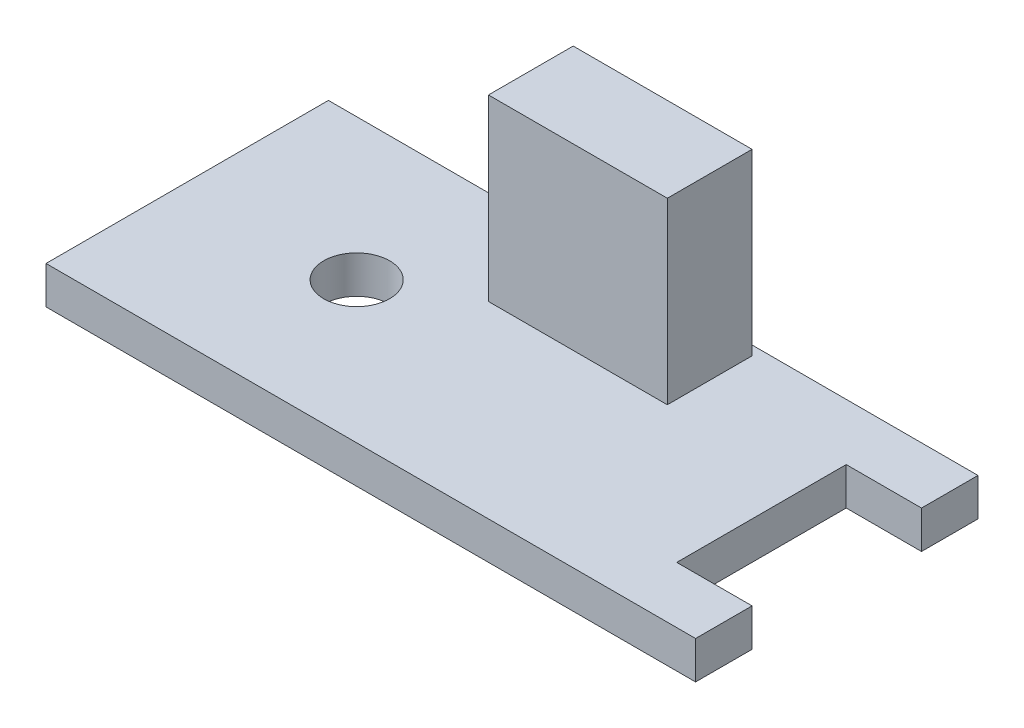
ISO-10303-21;
HEADER;
FILE_DESCRIPTION(('STEP AP214'),'2;1');
FILE_NAME('part.step','',(''),(''),'','','');
FILE_SCHEMA(('AUTOMOTIVE_DESIGN { 1 0 10303 214 1 1 1 1 }'));
ENDSEC;
DATA;
#1=APPLICATION_CONTEXT('core data for automotive mechanical design processes');
#2=APPLICATION_PROTOCOL_DEFINITION('international standard','automotive_design',2000,#1);
#3=PRODUCT_CONTEXT('',#1,'mechanical');
#4=PRODUCT('Part','Part','',(#3));
#5=PRODUCT_RELATED_PRODUCT_CATEGORY('part','',(#4));
#6=PRODUCT_DEFINITION_FORMATION('','',#4);
#7=PRODUCT_DEFINITION_CONTEXT('part definition',#1,'design');
#8=PRODUCT_DEFINITION('design','',#6,#7);
#9=PRODUCT_DEFINITION_SHAPE('','',#8);
#10=(LENGTH_UNIT() NAMED_UNIT(*) SI_UNIT(.MILLI.,.METRE.));
#11=(NAMED_UNIT(*) PLANE_ANGLE_UNIT() SI_UNIT($,.RADIAN.));
#12=(NAMED_UNIT(*) SI_UNIT($,.STERADIAN.) SOLID_ANGLE_UNIT());
#13=UNCERTAINTY_MEASURE_WITH_UNIT(LENGTH_MEASURE(1.E-05),#10,'distance_accuracy_value','');
#14=(GEOMETRIC_REPRESENTATION_CONTEXT(3) GLOBAL_UNCERTAINTY_ASSIGNED_CONTEXT((#13)) GLOBAL_UNIT_ASSIGNED_CONTEXT((#10,
#11,#12)) REPRESENTATION_CONTEXT('',''));
#15=CARTESIAN_POINT('',(0.,0.,0.));
#16=DIRECTION('',(0.,0.,1.));
#17=DIRECTION('',(1.,0.,0.));
#18=AXIS2_PLACEMENT_3D('',#15,#16,#17);
#19=CARTESIAN_POINT('',(0.,2.,0.));
#20=DIRECTION('',(0.,-1.,0.));
#21=DIRECTION('',(0.,0.,-1.));
#22=AXIS2_PLACEMENT_3D('',#19,#20,#21);
#23=PLANE('',#22);
#24=CARTESIAN_POINT('',(-8.25,2.,0.));
#25=DIRECTION('',(0.,1.,0.));
#26=DIRECTION('',(0.,0.,1.));
#27=AXIS2_PLACEMENT_3D('',#24,#25,#26);
#28=CIRCLE('',#27,1.75);
#29=CARTESIAN_POINT('',(-8.25,2.,1.75));
#30=VERTEX_POINT('',#29);
#31=EDGE_CURVE('E145',#30,#30,#28,.T.);
#32=ORIENTED_EDGE('',*,*,#31,.F.);
#33=EDGE_LOOP('',(#32));
#34=FACE_BOUND('',#33,.T.);
#35=DIRECTION('',(0.,0.,-1.));
#36=VECTOR('',#35,1.);
#37=CARTESIAN_POINT('',(17.25,2.,-4.5));
#38=LINE('',#37,#36);
#39=CARTESIAN_POINT('',(17.25,2.,-4.5));
#40=VERTEX_POINT('',#39);
#41=CARTESIAN_POINT('',(17.25,2.,-7.5));
#42=VERTEX_POINT('',#41);
#43=EDGE_CURVE('E154',#40,#42,#38,.T.);
#44=ORIENTED_EDGE('',*,*,#43,.T.);
#45=DIRECTION('',(-1.,0.,0.));
#46=VECTOR('',#45,1.);
#47=CARTESIAN_POINT('',(-17.25,2.,-7.5));
#48=LINE('',#47,#46);
#49=CARTESIAN_POINT('',(-17.25,2.,-7.5));
#50=VERTEX_POINT('',#49);
#51=EDGE_CURVE('E157',#42,#50,#48,.T.);
#52=ORIENTED_EDGE('',*,*,#51,.T.);
#53=DIRECTION('',(0.,0.,1.));
#54=VECTOR('',#53,1.);
#55=CARTESIAN_POINT('',(-17.25,2.,7.5));
#56=LINE('',#55,#54);
#57=CARTESIAN_POINT('',(-17.25,2.,7.5));
#58=VERTEX_POINT('',#57);
#59=EDGE_CURVE('E160',#50,#58,#56,.T.);
#60=ORIENTED_EDGE('',*,*,#59,.T.);
#61=DIRECTION('',(1.,0.,0.));
#62=VECTOR('',#61,1.);
#63=CARTESIAN_POINT('',(-17.25,2.,7.5));
#64=LINE('',#63,#62);
#65=CARTESIAN_POINT('',(17.25,2.,7.5));
#66=VERTEX_POINT('',#65);
#67=EDGE_CURVE('E162',#58,#66,#64,.T.);
#68=ORIENTED_EDGE('',*,*,#67,.T.);
#69=DIRECTION('',(0.,0.,-1.));
#70=VECTOR('',#69,1.);
#71=CARTESIAN_POINT('',(17.25,2.,7.5));
#72=LINE('',#71,#70);
#73=CARTESIAN_POINT('',(17.25,2.,4.5));
#74=VERTEX_POINT('',#73);
#75=EDGE_CURVE('E164',#66,#74,#72,.T.);
#76=ORIENTED_EDGE('',*,*,#75,.T.);
#77=DIRECTION('',(-1.,0.,0.));
#78=VECTOR('',#77,1.);
#79=CARTESIAN_POINT('',(13.25,2.,4.5));
#80=LINE('',#79,#78);
#81=CARTESIAN_POINT('',(13.25,2.,4.5));
#82=VERTEX_POINT('',#81);
#83=EDGE_CURVE('E166',#74,#82,#80,.T.);
#84=ORIENTED_EDGE('',*,*,#83,.T.);
#85=DIRECTION('',(0.,0.,-1.));
#86=VECTOR('',#85,1.);
#87=CARTESIAN_POINT('',(13.25,2.,-4.5));
#88=LINE('',#87,#86);
#89=CARTESIAN_POINT('',(13.25,2.,-4.5));
#90=VERTEX_POINT('',#89);
#91=EDGE_CURVE('E168',#82,#90,#88,.T.);
#92=ORIENTED_EDGE('',*,*,#91,.T.);
#93=DIRECTION('',(1.,0.,0.));
#94=VECTOR('',#93,1.);
#95=CARTESIAN_POINT('',(17.25,2.,-4.5));
#96=LINE('',#95,#94);
#97=EDGE_CURVE('E170',#90,#40,#96,.T.);
#98=ORIENTED_EDGE('',*,*,#97,.T.);
#99=EDGE_LOOP('',(#44,#52,#60,#68,#76,#84,#92,#98));
#100=FACE_BOUND('',#99,.T.);
#101=DIRECTION('',(0.,0.,-1.));
#102=VECTOR('',#101,1.);
#103=CARTESIAN_POINT('',(5.74999999999999,2.,-7.));
#104=LINE('',#103,#102);
#105=CARTESIAN_POINT('',(5.74999999999999,2.,-2.5));
#106=VERTEX_POINT('',#105);
#107=CARTESIAN_POINT('',(5.74999999999999,2.,-7.));
#108=VERTEX_POINT('',#107);
#109=EDGE_CURVE('E141',#106,#108,#104,.T.);
#110=ORIENTED_EDGE('',*,*,#109,.F.);
#111=DIRECTION('',(1.,0.,0.));
#112=VECTOR('',#111,1.);
#113=CARTESIAN_POINT('',(-3.75,2.,-2.5));
#114=LINE('',#113,#112);
#115=CARTESIAN_POINT('',(-3.75,2.,-2.5));
#116=VERTEX_POINT('',#115);
#117=EDGE_CURVE('E138',#116,#106,#114,.T.);
#118=ORIENTED_EDGE('',*,*,#117,.F.);
#119=DIRECTION('',(0.,0.,1.));
#120=VECTOR('',#119,1.);
#121=CARTESIAN_POINT('',(-3.75,2.,-7.));
#122=LINE('',#121,#120);
#123=CARTESIAN_POINT('',(-3.75,2.,-7.));
#124=VERTEX_POINT('',#123);
#125=EDGE_CURVE('E52',#124,#116,#122,.T.);
#126=ORIENTED_EDGE('',*,*,#125,.F.);
#127=DIRECTION('',(-1.,0.,0.));
#128=VECTOR('',#127,1.);
#129=CARTESIAN_POINT('',(-3.75,2.,-7.));
#130=LINE('',#129,#128);
#131=EDGE_CURVE('E47',#108,#124,#130,.T.);
#132=ORIENTED_EDGE('',*,*,#131,.F.);
#133=EDGE_LOOP('',(#110,#118,#126,#132));
#134=FACE_BOUND('',#133,.T.);
#135=ADVANCED_FACE('F32',(#34,#100,#134),#23,.F.);
#136=CARTESIAN_POINT('',(0.,0.,0.));
#137=DIRECTION('',(0.,-1.,0.));
#138=DIRECTION('',(0.,0.,-1.));
#139=AXIS2_PLACEMENT_3D('',#136,#137,#138);
#140=PLANE('',#139);
#141=DIRECTION('',(0.,0.,-1.));
#142=VECTOR('',#141,1.);
#143=CARTESIAN_POINT('',(17.25,0.,-4.5));
#144=LINE('',#143,#142);
#145=CARTESIAN_POINT('',(17.25,0.,-4.5));
#146=VERTEX_POINT('',#145);
#147=CARTESIAN_POINT('',(17.25,0.,-7.5));
#148=VERTEX_POINT('',#147);
#149=EDGE_CURVE('E152',#146,#148,#144,.T.);
#150=ORIENTED_EDGE('',*,*,#149,.F.);
#151=DIRECTION('',(1.,0.,0.));
#152=VECTOR('',#151,1.);
#153=CARTESIAN_POINT('',(17.25,0.,-4.5));
#154=LINE('',#153,#152);
#155=CARTESIAN_POINT('',(13.25,0.,-4.5));
#156=VERTEX_POINT('',#155);
#157=EDGE_CURVE('E158',#156,#146,#154,.T.);
#158=ORIENTED_EDGE('',*,*,#157,.F.);
#159=DIRECTION('',(0.,0.,-1.));
#160=VECTOR('',#159,1.);
#161=CARTESIAN_POINT('',(13.25,0.,-4.5));
#162=LINE('',#161,#160);
#163=CARTESIAN_POINT('',(13.25,0.,4.5));
#164=VERTEX_POINT('',#163);
#165=EDGE_CURVE('E185',#164,#156,#162,.T.);
#166=ORIENTED_EDGE('',*,*,#165,.F.);
#167=DIRECTION('',(-1.,0.,0.));
#168=VECTOR('',#167,1.);
#169=CARTESIAN_POINT('',(13.25,0.,4.5));
#170=LINE('',#169,#168);
#171=CARTESIAN_POINT('',(17.25,0.,4.5));
#172=VERTEX_POINT('',#171);
#173=EDGE_CURVE('E183',#172,#164,#170,.T.);
#174=ORIENTED_EDGE('',*,*,#173,.F.);
#175=DIRECTION('',(0.,0.,-1.));
#176=VECTOR('',#175,1.);
#177=CARTESIAN_POINT('',(17.25,0.,7.5));
#178=LINE('',#177,#176);
#179=CARTESIAN_POINT('',(17.25,0.,7.5));
#180=VERTEX_POINT('',#179);
#181=EDGE_CURVE('E181',#180,#172,#178,.T.);
#182=ORIENTED_EDGE('',*,*,#181,.F.);
#183=DIRECTION('',(1.,0.,0.));
#184=VECTOR('',#183,1.);
#185=CARTESIAN_POINT('',(-17.25,0.,7.5));
#186=LINE('',#185,#184);
#187=CARTESIAN_POINT('',(-17.25,0.,7.5));
#188=VERTEX_POINT('',#187);
#189=EDGE_CURVE('E179',#188,#180,#186,.T.);
#190=ORIENTED_EDGE('',*,*,#189,.F.);
#191=DIRECTION('',(0.,0.,1.));
#192=VECTOR('',#191,1.);
#193=CARTESIAN_POINT('',(-17.25,0.,7.5));
#194=LINE('',#193,#192);
#195=CARTESIAN_POINT('',(-17.25,0.,-7.5));
#196=VERTEX_POINT('',#195);
#197=EDGE_CURVE('E177',#196,#188,#194,.T.);
#198=ORIENTED_EDGE('',*,*,#197,.F.);
#199=DIRECTION('',(-1.,0.,0.));
#200=VECTOR('',#199,1.);
#201=CARTESIAN_POINT('',(-17.25,0.,-7.5));
#202=LINE('',#201,#200);
#203=EDGE_CURVE('E175',#148,#196,#202,.T.);
#204=ORIENTED_EDGE('',*,*,#203,.F.);
#205=EDGE_LOOP('',(#150,#158,#166,#174,#182,#190,#198,#204));
#206=FACE_BOUND('',#205,.T.);
#207=CARTESIAN_POINT('',(-8.25,0.,0.));
#208=DIRECTION('',(0.,1.,0.));
#209=DIRECTION('',(0.,0.,1.));
#210=AXIS2_PLACEMENT_3D('',#207,#208,#209);
#211=CIRCLE('',#210,1.75);
#212=CARTESIAN_POINT('',(-8.25,0.,1.75));
#213=VERTEX_POINT('',#212);
#214=EDGE_CURVE('E142',#213,#213,#211,.T.);
#215=ORIENTED_EDGE('',*,*,#214,.T.);
#216=EDGE_LOOP('',(#215));
#217=FACE_BOUND('',#216,.T.);
#218=ADVANCED_FACE('F215',(#206,#217),#140,.T.);
#219=CARTESIAN_POINT('',(17.25,2.,-4.5));
#220=DIRECTION('',(-1.,0.,0.));
#221=DIRECTION('',(0.,0.,1.));
#222=AXIS2_PLACEMENT_3D('',#219,#220,#221);
#223=PLANE('',#222);
#224=ORIENTED_EDGE('',*,*,#149,.T.);
#225=DIRECTION('',(0.,-1.,0.));
#226=VECTOR('',#225,1.);
#227=CARTESIAN_POINT('',(17.25,2.,-7.5));
#228=LINE('',#227,#226);
#229=EDGE_CURVE('E11',#42,#148,#228,.T.);
#230=ORIENTED_EDGE('',*,*,#229,.F.);
#231=ORIENTED_EDGE('',*,*,#43,.F.);
#232=DIRECTION('',(0.,-1.,0.));
#233=VECTOR('',#232,1.);
#234=CARTESIAN_POINT('',(17.25,2.,-4.5));
#235=LINE('',#234,#233);
#236=EDGE_CURVE('E172',#40,#146,#235,.T.);
#237=ORIENTED_EDGE('',*,*,#236,.T.);
#238=EDGE_LOOP('',(#224,#230,#231,#237));
#239=FACE_BOUND('',#238,.T.);
#240=ADVANCED_FACE('F34',(#239),#223,.F.);
#241=CARTESIAN_POINT('',(-17.25,2.,-7.5));
#242=DIRECTION('',(0.,0.,1.));
#243=DIRECTION('',(1.,0.,0.));
#244=AXIS2_PLACEMENT_3D('',#241,#242,#243);
#245=PLANE('',#244);
#246=ORIENTED_EDGE('',*,*,#203,.T.);
#247=DIRECTION('',(0.,-1.,0.));
#248=VECTOR('',#247,1.);
#249=CARTESIAN_POINT('',(-17.25,2.,-7.5));
#250=LINE('',#249,#248);
#251=EDGE_CURVE('E40',#50,#196,#250,.T.);
#252=ORIENTED_EDGE('',*,*,#251,.F.);
#253=ORIENTED_EDGE('',*,*,#51,.F.);
#254=ORIENTED_EDGE('',*,*,#229,.T.);
#255=EDGE_LOOP('',(#246,#252,#253,#254));
#256=FACE_BOUND('',#255,.T.);
#257=ADVANCED_FACE('F232',(#256),#245,.F.);
#258=CARTESIAN_POINT('',(-17.25,2.,7.5));
#259=DIRECTION('',(1.,0.,0.));
#260=DIRECTION('',(0.,0.,-1.));
#261=AXIS2_PLACEMENT_3D('',#258,#259,#260);
#262=PLANE('',#261);
#263=ORIENTED_EDGE('',*,*,#197,.T.);
#264=DIRECTION('',(0.,-1.,0.));
#265=VECTOR('',#264,1.);
#266=CARTESIAN_POINT('',(-17.25,2.,7.5));
#267=LINE('',#266,#265);
#268=EDGE_CURVE('E202',#58,#188,#267,.T.);
#269=ORIENTED_EDGE('',*,*,#268,.F.);
#270=ORIENTED_EDGE('',*,*,#59,.F.);
#271=ORIENTED_EDGE('',*,*,#251,.T.);
#272=EDGE_LOOP('',(#263,#269,#270,#271));
#273=FACE_BOUND('',#272,.T.);
#274=ADVANCED_FACE('F209',(#273),#262,.F.);
#275=CARTESIAN_POINT('',(-17.25,2.,7.5));
#276=DIRECTION('',(0.,0.,-1.));
#277=DIRECTION('',(-1.,0.,0.));
#278=AXIS2_PLACEMENT_3D('',#275,#276,#277);
#279=PLANE('',#278);
#280=ORIENTED_EDGE('',*,*,#189,.T.);
#281=DIRECTION('',(0.,-1.,0.));
#282=VECTOR('',#281,1.);
#283=CARTESIAN_POINT('',(17.25,2.,7.5));
#284=LINE('',#283,#282);
#285=EDGE_CURVE('E199',#66,#180,#284,.T.);
#286=ORIENTED_EDGE('',*,*,#285,.F.);
#287=ORIENTED_EDGE('',*,*,#67,.F.);
#288=ORIENTED_EDGE('',*,*,#268,.T.);
#289=EDGE_LOOP('',(#280,#286,#287,#288));
#290=FACE_BOUND('',#289,.T.);
#291=ADVANCED_FACE('F221',(#290),#279,.F.);
#292=CARTESIAN_POINT('',(17.25,2.,7.5));
#293=DIRECTION('',(-1.,0.,0.));
#294=DIRECTION('',(0.,0.,1.));
#295=AXIS2_PLACEMENT_3D('',#292,#293,#294);
#296=PLANE('',#295);
#297=ORIENTED_EDGE('',*,*,#181,.T.);
#298=DIRECTION('',(0.,-1.,0.));
#299=VECTOR('',#298,1.);
#300=CARTESIAN_POINT('',(17.25,2.,4.5));
#301=LINE('',#300,#299);
#302=EDGE_CURVE('E196',#74,#172,#301,.T.);
#303=ORIENTED_EDGE('',*,*,#302,.F.);
#304=ORIENTED_EDGE('',*,*,#75,.F.);
#305=ORIENTED_EDGE('',*,*,#285,.T.);
#306=EDGE_LOOP('',(#297,#303,#304,#305));
#307=FACE_BOUND('',#306,.T.);
#308=ADVANCED_FACE('F225',(#307),#296,.F.);
#309=CARTESIAN_POINT('',(13.25,2.,4.5));
#310=DIRECTION('',(0.,0.,1.));
#311=DIRECTION('',(1.,0.,0.));
#312=AXIS2_PLACEMENT_3D('',#309,#310,#311);
#313=PLANE('',#312);
#314=ORIENTED_EDGE('',*,*,#173,.T.);
#315=DIRECTION('',(0.,-1.,0.));
#316=VECTOR('',#315,1.);
#317=CARTESIAN_POINT('',(13.25,2.,4.5));
#318=LINE('',#317,#316);
#319=EDGE_CURVE('E193',#82,#164,#318,.T.);
#320=ORIENTED_EDGE('',*,*,#319,.F.);
#321=ORIENTED_EDGE('',*,*,#83,.F.);
#322=ORIENTED_EDGE('',*,*,#302,.T.);
#323=EDGE_LOOP('',(#314,#320,#321,#322));
#324=FACE_BOUND('',#323,.T.);
#325=ADVANCED_FACE('F245',(#324),#313,.F.);
#326=CARTESIAN_POINT('',(13.25,2.,-4.5));
#327=DIRECTION('',(-1.,0.,0.));
#328=DIRECTION('',(0.,0.,1.));
#329=AXIS2_PLACEMENT_3D('',#326,#327,#328);
#330=PLANE('',#329);
#331=ORIENTED_EDGE('',*,*,#165,.T.);
#332=DIRECTION('',(0.,-1.,0.));
#333=VECTOR('',#332,1.);
#334=CARTESIAN_POINT('',(13.25,2.,-4.5));
#335=LINE('',#334,#333);
#336=EDGE_CURVE('E190',#90,#156,#335,.T.);
#337=ORIENTED_EDGE('',*,*,#336,.F.);
#338=ORIENTED_EDGE('',*,*,#91,.F.);
#339=ORIENTED_EDGE('',*,*,#319,.T.);
#340=EDGE_LOOP('',(#331,#337,#338,#339));
#341=FACE_BOUND('',#340,.T.);
#342=ADVANCED_FACE('F243',(#341),#330,.F.);
#343=CARTESIAN_POINT('',(17.25,2.,-4.5));
#344=DIRECTION('',(0.,0.,-1.));
#345=DIRECTION('',(-1.,0.,0.));
#346=AXIS2_PLACEMENT_3D('',#343,#344,#345);
#347=PLANE('',#346);
#348=ORIENTED_EDGE('',*,*,#157,.T.);
#349=ORIENTED_EDGE('',*,*,#236,.F.);
#350=ORIENTED_EDGE('',*,*,#97,.F.);
#351=ORIENTED_EDGE('',*,*,#336,.T.);
#352=EDGE_LOOP('',(#348,#349,#350,#351));
#353=FACE_BOUND('',#352,.T.);
#354=ADVANCED_FACE('F238',(#353),#347,.F.);
#355=CARTESIAN_POINT('',(-8.25,2.,0.));
#356=DIRECTION('',(0.,-1.,0.));
#357=DIRECTION('',(0.,0.,-1.));
#358=AXIS2_PLACEMENT_3D('',#355,#356,#357);
#359=CYLINDRICAL_SURFACE('',#358,1.75);
#360=ORIENTED_EDGE('',*,*,#31,.T.);
#361=EDGE_LOOP('',(#360));
#362=FACE_BOUND('',#361,.T.);
#363=ORIENTED_EDGE('',*,*,#214,.F.);
#364=EDGE_LOOP('',(#363));
#365=FACE_BOUND('',#364,.T.);
#366=ADVANCED_FACE('F263',(#362,#365),#359,.F.);
#367=CARTESIAN_POINT('',(5.74999999999999,11.5,-7.));
#368=DIRECTION('',(-1.,0.,0.));
#369=DIRECTION('',(0.,0.,1.));
#370=AXIS2_PLACEMENT_3D('',#367,#368,#369);
#371=PLANE('',#370);
#372=ORIENTED_EDGE('',*,*,#109,.T.);
#373=DIRECTION('',(0.,-1.,0.));
#374=VECTOR('',#373,1.);
#375=CARTESIAN_POINT('',(5.74999999999999,11.5,-7.));
#376=LINE('',#375,#374);
#377=CARTESIAN_POINT('',(5.74999999999999,11.5,-7.));
#378=VERTEX_POINT('',#377);
#379=EDGE_CURVE('E122',#378,#108,#376,.T.);
#380=ORIENTED_EDGE('',*,*,#379,.F.);
#381=DIRECTION('',(0.,0.,-1.));
#382=VECTOR('',#381,1.);
#383=CARTESIAN_POINT('',(5.74999999999999,11.5,-7.));
#384=LINE('',#383,#382);
#385=CARTESIAN_POINT('',(5.74999999999999,11.5,-2.5));
#386=VERTEX_POINT('',#385);
#387=EDGE_CURVE('E129',#386,#378,#384,.T.);
#388=ORIENTED_EDGE('',*,*,#387,.F.);
#389=DIRECTION('',(0.,-1.,0.));
#390=VECTOR('',#389,1.);
#391=CARTESIAN_POINT('',(5.74999999999999,11.5,-2.5));
#392=LINE('',#391,#390);
#393=EDGE_CURVE('E384',#386,#106,#392,.T.);
#394=ORIENTED_EDGE('',*,*,#393,.T.);
#395=EDGE_LOOP('',(#372,#380,#388,#394));
#396=FACE_BOUND('',#395,.T.);
#397=ADVANCED_FACE('F140',(#396),#371,.F.);
#398=CARTESIAN_POINT('',(-3.75,11.5,-7.));
#399=DIRECTION('',(0.,0.,1.));
#400=DIRECTION('',(1.,0.,0.));
#401=AXIS2_PLACEMENT_3D('',#398,#399,#400);
#402=PLANE('',#401);
#403=ORIENTED_EDGE('',*,*,#131,.T.);
#404=DIRECTION('',(0.,-1.,0.));
#405=VECTOR('',#404,1.);
#406=CARTESIAN_POINT('',(-3.75,11.5,-7.));
#407=LINE('',#406,#405);
#408=CARTESIAN_POINT('',(-3.75,11.5,-7.));
#409=VERTEX_POINT('',#408);
#410=EDGE_CURVE('E125',#409,#124,#407,.T.);
#411=ORIENTED_EDGE('',*,*,#410,.F.);
#412=DIRECTION('',(-1.,0.,0.));
#413=VECTOR('',#412,1.);
#414=CARTESIAN_POINT('',(-3.75,11.5,-7.));
#415=LINE('',#414,#413);
#416=EDGE_CURVE('E118',#378,#409,#415,.T.);
#417=ORIENTED_EDGE('',*,*,#416,.F.);
#418=ORIENTED_EDGE('',*,*,#379,.T.);
#419=EDGE_LOOP('',(#403,#411,#417,#418));
#420=FACE_BOUND('',#419,.T.);
#421=ADVANCED_FACE('F120',(#420),#402,.F.);
#422=CARTESIAN_POINT('',(-3.75,11.5,-7.));
#423=DIRECTION('',(1.,0.,0.));
#424=DIRECTION('',(0.,0.,-1.));
#425=AXIS2_PLACEMENT_3D('',#422,#423,#424);
#426=PLANE('',#425);
#427=ORIENTED_EDGE('',*,*,#125,.T.);
#428=DIRECTION('',(0.,-1.,0.));
#429=VECTOR('',#428,1.);
#430=CARTESIAN_POINT('',(-3.75,11.5,-2.5));
#431=LINE('',#430,#429);
#432=CARTESIAN_POINT('',(-3.75,11.5,-2.5));
#433=VERTEX_POINT('',#432);
#434=EDGE_CURVE('E147',#433,#116,#431,.T.);
#435=ORIENTED_EDGE('',*,*,#434,.F.);
#436=DIRECTION('',(0.,0.,1.));
#437=VECTOR('',#436,1.);
#438=CARTESIAN_POINT('',(-3.75,11.5,-7.));
#439=LINE('',#438,#437);
#440=EDGE_CURVE('E128',#409,#433,#439,.T.);
#441=ORIENTED_EDGE('',*,*,#440,.F.);
#442=ORIENTED_EDGE('',*,*,#410,.T.);
#443=EDGE_LOOP('',(#427,#435,#441,#442));
#444=FACE_BOUND('',#443,.T.);
#445=ADVANCED_FACE('F279',(#444),#426,.F.);
#446=CARTESIAN_POINT('',(-3.75,11.5,-2.5));
#447=DIRECTION('',(0.,0.,-1.));
#448=DIRECTION('',(-1.,0.,0.));
#449=AXIS2_PLACEMENT_3D('',#446,#447,#448);
#450=PLANE('',#449);
#451=ORIENTED_EDGE('',*,*,#117,.T.);
#452=ORIENTED_EDGE('',*,*,#393,.F.);
#453=DIRECTION('',(1.,0.,0.));
#454=VECTOR('',#453,1.);
#455=CARTESIAN_POINT('',(-3.75,11.5,-2.5));
#456=LINE('',#455,#454);
#457=EDGE_CURVE('E134',#433,#386,#456,.T.);
#458=ORIENTED_EDGE('',*,*,#457,.F.);
#459=ORIENTED_EDGE('',*,*,#434,.T.);
#460=EDGE_LOOP('',(#451,#452,#458,#459));
#461=FACE_BOUND('',#460,.T.);
#462=ADVANCED_FACE('F284',(#461),#450,.F.);
#463=CARTESIAN_POINT('',(0.,11.5,0.));
#464=DIRECTION('',(0.,1.,0.));
#465=DIRECTION('',(0.,0.,1.));
#466=AXIS2_PLACEMENT_3D('',#463,#464,#465);
#467=PLANE('',#466);
#468=ORIENTED_EDGE('',*,*,#387,.T.);
#469=ORIENTED_EDGE('',*,*,#416,.T.);
#470=ORIENTED_EDGE('',*,*,#440,.T.);
#471=ORIENTED_EDGE('',*,*,#457,.T.);
#472=EDGE_LOOP('',(#468,#469,#470,#471));
#473=FACE_BOUND('',#472,.T.);
#474=ADVANCED_FACE('F132',(#473),#467,.T.);
#475=CLOSED_SHELL('',(#135,#218,#240,#257,#274,#291,#308,#325,#342,#354,#366,#397,#421,#445,
#462,#474));
#476=MANIFOLD_SOLID_BREP('B2',#475);
#477=ADVANCED_BREP_SHAPE_REPRESENTATION('',(#18,#476),#14);
#478=SHAPE_DEFINITION_REPRESENTATION(#9,#477);
ENDSEC;
END-ISO-10303-21;
